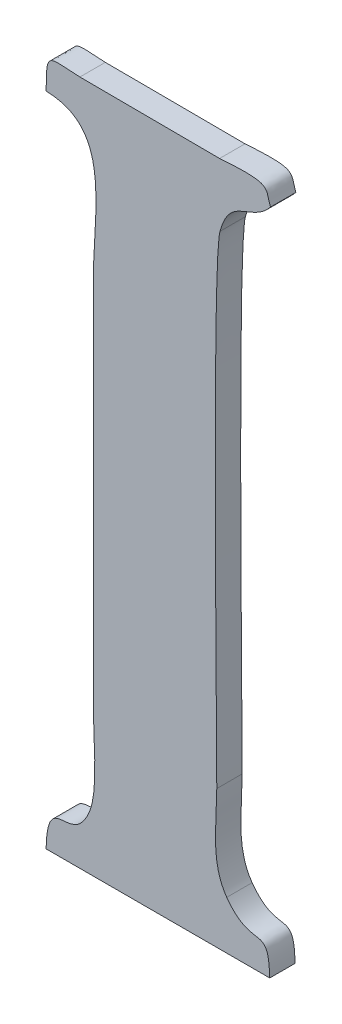
ISO-10303-21;
HEADER;
FILE_DESCRIPTION(('STEP AP214'),'2;1');
FILE_NAME('part.step','',(''),(''),'','','');
FILE_SCHEMA(('AUTOMOTIVE_DESIGN { 1 0 10303 214 1 1 1 1 }'));
ENDSEC;
DATA;
#1=APPLICATION_CONTEXT('core data for automotive mechanical design processes');
#2=APPLICATION_PROTOCOL_DEFINITION('international standard','automotive_design',2000,#1);
#3=PRODUCT_CONTEXT('',#1,'mechanical');
#4=PRODUCT('Part','Part','',(#3));
#5=PRODUCT_RELATED_PRODUCT_CATEGORY('part','',(#4));
#6=PRODUCT_DEFINITION_FORMATION('','',#4);
#7=PRODUCT_DEFINITION_CONTEXT('part definition',#1,'design');
#8=PRODUCT_DEFINITION('design','',#6,#7);
#9=PRODUCT_DEFINITION_SHAPE('','',#8);
#10=(LENGTH_UNIT() NAMED_UNIT(*) SI_UNIT(.MILLI.,.METRE.));
#11=(NAMED_UNIT(*) PLANE_ANGLE_UNIT() SI_UNIT($,.RADIAN.));
#12=(NAMED_UNIT(*) SI_UNIT($,.STERADIAN.) SOLID_ANGLE_UNIT());
#13=UNCERTAINTY_MEASURE_WITH_UNIT(LENGTH_MEASURE(1.E-05),#10,'distance_accuracy_value','');
#14=(GEOMETRIC_REPRESENTATION_CONTEXT(3) GLOBAL_UNCERTAINTY_ASSIGNED_CONTEXT((#13)) GLOBAL_UNIT_ASSIGNED_CONTEXT((#10,
#11,#12)) REPRESENTATION_CONTEXT('',''));
#15=CARTESIAN_POINT('',(0.,0.,0.));
#16=DIRECTION('',(0.,0.,1.));
#17=DIRECTION('',(1.,0.,0.));
#18=AXIS2_PLACEMENT_3D('',#15,#16,#17);
#19=CARTESIAN_POINT('',(0.0584275370021266,11.4810110226735,0.001));
#20=DIRECTION('',(-0.0050889926251414,-0.999987050993192,0.));
#21=DIRECTION('',(0.999987050993192,-0.0050889926251414,0.));
#22=AXIS2_PLACEMENT_3D('',#19,#20,#21);
#23=PLANE('',#22);
#24=DIRECTION('',(-0.999987050993192,0.0050889926251414,0.));
#25=VECTOR('',#24,1.);
#26=CARTESIAN_POINT('',(0.0584275370021266,11.4810110226735,0.));
#27=LINE('',#26,#25);
#28=CARTESIAN_POINT('',(50.1266319999998,11.226211,0.));
#29=VERTEX_POINT('',#28);
#30=CARTESIAN_POINT('',(50.1211299999998,11.226239,0.));
#31=VERTEX_POINT('',#30);
#32=EDGE_CURVE('E11',#29,#31,#27,.T.);
#33=ORIENTED_EDGE('',*,*,#32,.T.);
#34=DIRECTION('',(0.,0.,-1.));
#35=VECTOR('',#34,1.);
#36=CARTESIAN_POINT('',(50.1211299999998,11.226239,0.001));
#37=LINE('',#36,#35);
#38=CARTESIAN_POINT('',(50.1211299999998,11.226239,0.001));
#39=VERTEX_POINT('',#38);
#40=EDGE_CURVE('E24',#39,#31,#37,.T.);
#41=ORIENTED_EDGE('',*,*,#40,.F.);
#42=DIRECTION('',(-0.999987050993192,0.0050889926251414,0.));
#43=VECTOR('',#42,1.);
#44=CARTESIAN_POINT('',(0.0584275370021266,11.4810110226735,0.001));
#45=LINE('',#44,#43);
#46=CARTESIAN_POINT('',(50.1266319999998,11.226211,0.001));
#47=VERTEX_POINT('',#46);
#48=EDGE_CURVE('E284',#47,#39,#45,.T.);
#49=ORIENTED_EDGE('',*,*,#48,.F.);
#50=DIRECTION('',(0.,0.,-1.));
#51=VECTOR('',#50,1.);
#52=CARTESIAN_POINT('',(50.1266319999998,11.226211,0.001));
#53=LINE('',#52,#51);
#54=EDGE_CURVE('E124',#47,#29,#53,.T.);
#55=ORIENTED_EDGE('',*,*,#54,.T.);
#56=EDGE_LOOP('',(#33,#41,#49,#55));
#57=FACE_BOUND('',#56,.T.);
#58=ADVANCED_FACE('F17',(#57),#23,.F.);
#59=CARTESIAN_POINT('',(50.1211299999998,11.226239,0.001));
#60=CARTESIAN_POINT('',(50.1211299999998,11.226239,0.));
#61=CARTESIAN_POINT('',(50.1198139999998,11.226295,0.001));
#62=CARTESIAN_POINT('',(50.1198139999998,11.226295,0.));
#63=CARTESIAN_POINT('',(50.1198139999998,11.226505,0.001));
#64=CARTESIAN_POINT('',(50.1198139999998,11.226505,0.));
#65=CARTESIAN_POINT('',(50.1197999999998,11.225091,0.001));
#66=CARTESIAN_POINT('',(50.1197999999998,11.225091,0.));
#67=B_SPLINE_SURFACE_WITH_KNOTS('',3,1,((#59,#60),(#61,#62),(#63,#64),(#65,#66)),.UNSPECIFIED.,
.F.,.F.,.F.,(4,4),(2,2),(0.846153846153846,1.),(0.,1.),.UNSPECIFIED.);
#68=CARTESIAN_POINT('',(50.1211299999998,11.226239,0.));
#69=CARTESIAN_POINT('',(50.1198139999998,11.226295,0.));
#70=CARTESIAN_POINT('',(50.1198139999998,11.226505,0.));
#71=CARTESIAN_POINT('',(50.1197999999998,11.225091,0.));
#72=B_SPLINE_CURVE_WITH_KNOTS('',3,(#68,#69,#70,#71),.UNSPECIFIED.,.F.,.F.,(4,4),
(0.846153846153846,1.),.UNSPECIFIED.);
#73=CARTESIAN_POINT('',(50.1197999999998,11.225091,0.));
#74=VERTEX_POINT('',#73);
#75=EDGE_CURVE('E275',#31,#74,#72,.T.);
#76=DIRECTION('',(0.,0.,-1.));
#77=VECTOR('',#76,1.);
#78=CARTESIAN_POINT('',(50.1197999999998,11.225091,0.001));
#79=LINE('',#78,#77);
#80=CARTESIAN_POINT('',(50.1197999999998,11.225091,0.001));
#81=VERTEX_POINT('',#80);
#82=EDGE_CURVE('E270',#81,#74,#79,.T.);
#83=CARTESIAN_POINT('',(50.1211299999998,11.226239,0.001));
#84=CARTESIAN_POINT('',(50.1198139999998,11.226295,0.001));
#85=CARTESIAN_POINT('',(50.1198139999998,11.226505,0.001));
#86=CARTESIAN_POINT('',(50.1197999999998,11.225091,0.001));
#87=B_SPLINE_CURVE_WITH_KNOTS('',3,(#83,#84,#85,#86),.UNSPECIFIED.,.F.,.F.,(4,4),
(0.846153846153846,1.),.UNSPECIFIED.);
#88=EDGE_CURVE('E263',#39,#81,#87,.T.);
#89=ORIENTED_EDGE('',*,*,#75,.T.);
#90=ORIENTED_EDGE('',*,*,#82,.F.);
#91=ORIENTED_EDGE('',*,*,#88,.F.);
#92=ORIENTED_EDGE('',*,*,#40,.T.);
#93=EDGE_LOOP('',(#89,#90,#91,#92));
#94=FACE_BOUND('',#93,.T.);
#95=ADVANCED_FACE('F287',(#94),#67,.F.);
#96=CARTESIAN_POINT('',(50.1197999999998,11.225091,0.001));
#97=CARTESIAN_POINT('',(50.1197999999998,11.225091,0.));
#98=CARTESIAN_POINT('',(50.1224179999998,11.225035,0.001));
#99=CARTESIAN_POINT('',(50.1224179999998,11.225035,0.));
#100=CARTESIAN_POINT('',(50.1216619999998,11.221997,0.001));
#101=CARTESIAN_POINT('',(50.1216619999998,11.221997,0.));
#102=CARTESIAN_POINT('',(50.1216619999998,11.219673,0.001));
#103=CARTESIAN_POINT('',(50.1216619999998,11.219673,0.));
#104=B_SPLINE_SURFACE_WITH_KNOTS('',3,1,((#96,#97),(#98,#99),(#100,#101),(#102,#103)),
.UNSPECIFIED.,.F.,.F.,.F.,(4,4),(2,2),(0.,0.0769230769230769),(0.,1.),.UNSPECIFIED.);
#105=CARTESIAN_POINT('',(50.1197999999998,11.225091,0.));
#106=CARTESIAN_POINT('',(50.1224179999998,11.225035,0.));
#107=CARTESIAN_POINT('',(50.1216619999998,11.221997,0.));
#108=CARTESIAN_POINT('',(50.1216619999998,11.219673,0.));
#109=B_SPLINE_CURVE_WITH_KNOTS('',3,(#105,#106,#107,#108),.UNSPECIFIED.,.F.,.F.,(4,4),(0.,
0.0769230769230769),.UNSPECIFIED.);
#110=CARTESIAN_POINT('',(50.1216619999998,11.219673,0.));
#111=VERTEX_POINT('',#110);
#112=EDGE_CURVE('E258',#74,#111,#109,.T.);
#113=DIRECTION('',(0.,0.,-1.));
#114=VECTOR('',#113,1.);
#115=CARTESIAN_POINT('',(50.1216619999998,11.219673,0.001));
#116=LINE('',#115,#114);
#117=CARTESIAN_POINT('',(50.1216619999998,11.219673,0.001));
#118=VERTEX_POINT('',#117);
#119=EDGE_CURVE('E253',#118,#111,#116,.T.);
#120=CARTESIAN_POINT('',(50.1197999999998,11.225091,0.001));
#121=CARTESIAN_POINT('',(50.1224179999998,11.225035,0.001));
#122=CARTESIAN_POINT('',(50.1216619999998,11.221997,0.001));
#123=CARTESIAN_POINT('',(50.1216619999998,11.219673,0.001));
#124=B_SPLINE_CURVE_WITH_KNOTS('',3,(#120,#121,#122,#123),.UNSPECIFIED.,.F.,.F.,(4,4),(0.,
0.0769230769230769),.UNSPECIFIED.);
#125=EDGE_CURVE('E249',#81,#118,#124,.T.);
#126=ORIENTED_EDGE('',*,*,#112,.T.);
#127=ORIENTED_EDGE('',*,*,#119,.F.);
#128=ORIENTED_EDGE('',*,*,#125,.F.);
#129=ORIENTED_EDGE('',*,*,#82,.T.);
#130=EDGE_LOOP('',(#126,#127,#128,#129));
#131=FACE_BOUND('',#130,.T.);
#132=ADVANCED_FACE('F295',(#131),#104,.F.);
#133=CARTESIAN_POINT('',(50.1216619999998,0.,0.001));
#134=DIRECTION('',(1.,0.,0.));
#135=DIRECTION('',(0.,0.,-1.));
#136=AXIS2_PLACEMENT_3D('',#133,#134,#135);
#137=PLANE('',#136);
#138=DIRECTION('',(0.,-1.,0.));
#139=VECTOR('',#138,1.);
#140=CARTESIAN_POINT('',(50.1216619999998,0.,0.));
#141=LINE('',#140,#139);
#142=CARTESIAN_POINT('',(50.1216619999998,11.204917,0.));
#143=VERTEX_POINT('',#142);
#144=EDGE_CURVE('E247',#111,#143,#141,.T.);
#145=ORIENTED_EDGE('',*,*,#144,.T.);
#146=DIRECTION('',(0.,0.,-1.));
#147=VECTOR('',#146,1.);
#148=CARTESIAN_POINT('',(50.1216619999998,11.204917,0.001));
#149=LINE('',#148,#147);
#150=CARTESIAN_POINT('',(50.1216619999998,11.204917,0.001));
#151=VERTEX_POINT('',#150);
#152=EDGE_CURVE('E244',#151,#143,#149,.T.);
#153=ORIENTED_EDGE('',*,*,#152,.F.);
#154=DIRECTION('',(0.,-1.,0.));
#155=VECTOR('',#154,1.);
#156=CARTESIAN_POINT('',(50.1216619999998,0.,0.001));
#157=LINE('',#156,#155);
#158=EDGE_CURVE('E238',#118,#151,#157,.T.);
#159=ORIENTED_EDGE('',*,*,#158,.F.);
#160=ORIENTED_EDGE('',*,*,#119,.T.);
#161=EDGE_LOOP('',(#145,#153,#159,#160));
#162=FACE_BOUND('',#161,.T.);
#163=ADVANCED_FACE('F325',(#162),#137,.F.);
#164=CARTESIAN_POINT('',(50.1216619999998,11.204917,0.001));
#165=CARTESIAN_POINT('',(50.1216619999998,11.204917,0.));
#166=CARTESIAN_POINT('',(50.1216619999998,11.203909,0.001));
#167=CARTESIAN_POINT('',(50.1216619999998,11.203909,0.));
#168=CARTESIAN_POINT('',(50.1218579999998,11.202229,0.001));
#169=CARTESIAN_POINT('',(50.1218579999998,11.202229,0.));
#170=CARTESIAN_POINT('',(50.1215079999998,11.201375,0.001));
#171=CARTESIAN_POINT('',(50.1215079999998,11.201375,0.));
#172=B_SPLINE_SURFACE_WITH_KNOTS('',3,1,((#164,#165),(#166,#167),(#168,#169),(#170,#171)),
.UNSPECIFIED.,.F.,.F.,.F.,(4,4),(2,2),(0.153846153846154,0.230769230769231),(0.,1.),.UNSPECIFIED.);
#173=CARTESIAN_POINT('',(50.1216619999998,11.204917,0.));
#174=CARTESIAN_POINT('',(50.1216619999998,11.203909,0.));
#175=CARTESIAN_POINT('',(50.1218579999998,11.202229,0.));
#176=CARTESIAN_POINT('',(50.1215079999998,11.201375,0.));
#177=B_SPLINE_CURVE_WITH_KNOTS('',3,(#173,#174,#175,#176),.UNSPECIFIED.,.F.,.F.,(4,4),
(0.153846153846154,0.230769230769231),.UNSPECIFIED.);
#178=CARTESIAN_POINT('',(50.1215079999998,11.201375,0.));
#179=VERTEX_POINT('',#178);
#180=EDGE_CURVE('E233',#143,#179,#177,.T.);
#181=DIRECTION('',(0.,0.,-1.));
#182=VECTOR('',#181,1.);
#183=CARTESIAN_POINT('',(50.1215079999998,11.201375,0.001));
#184=LINE('',#183,#182);
#185=CARTESIAN_POINT('',(50.1215079999998,11.201375,0.001));
#186=VERTEX_POINT('',#185);
#187=EDGE_CURVE('E228',#186,#179,#184,.T.);
#188=CARTESIAN_POINT('',(50.1216619999998,11.204917,0.001));
#189=CARTESIAN_POINT('',(50.1216619999998,11.203909,0.001));
#190=CARTESIAN_POINT('',(50.1218579999998,11.202229,0.001));
#191=CARTESIAN_POINT('',(50.1215079999998,11.201375,0.001));
#192=B_SPLINE_CURVE_WITH_KNOTS('',3,(#188,#189,#190,#191),.UNSPECIFIED.,.F.,.F.,(4,4),
(0.153846153846154,0.230769230769231),.UNSPECIFIED.);
#193=EDGE_CURVE('E221',#151,#186,#192,.T.);
#194=ORIENTED_EDGE('',*,*,#180,.T.);
#195=ORIENTED_EDGE('',*,*,#187,.F.);
#196=ORIENTED_EDGE('',*,*,#193,.F.);
#197=ORIENTED_EDGE('',*,*,#152,.T.);
#198=EDGE_LOOP('',(#194,#195,#196,#197));
#199=FACE_BOUND('',#198,.T.);
#200=ADVANCED_FACE('F323',(#199),#172,.F.);
#201=CARTESIAN_POINT('',(50.1215079999998,11.201375,0.001));
#202=CARTESIAN_POINT('',(50.1215079999998,11.201375,0.));
#203=CARTESIAN_POINT('',(50.1208359999998,11.199709,0.001));
#204=CARTESIAN_POINT('',(50.1208359999998,11.199709,0.));
#205=CARTESIAN_POINT('',(50.1198419999998,11.201529,0.001));
#206=CARTESIAN_POINT('',(50.1198419999998,11.201529,0.));
#207=CARTESIAN_POINT('',(50.1197999999998,11.199247,0.001));
#208=CARTESIAN_POINT('',(50.1197999999998,11.199247,0.));
#209=B_SPLINE_SURFACE_WITH_KNOTS('',3,1,((#201,#202),(#203,#204),(#205,#206),(#207,#208)),
.UNSPECIFIED.,.F.,.F.,.F.,(4,4),(2,2),(0.230769230769231,0.307692307692308),(0.,1.),.UNSPECIFIED.);
#210=CARTESIAN_POINT('',(50.1215079999998,11.201375,0.));
#211=CARTESIAN_POINT('',(50.1208359999998,11.199709,0.));
#212=CARTESIAN_POINT('',(50.1198419999998,11.201529,0.));
#213=CARTESIAN_POINT('',(50.1197999999998,11.199247,0.));
#214=B_SPLINE_CURVE_WITH_KNOTS('',3,(#210,#211,#212,#213),.UNSPECIFIED.,.F.,.F.,(4,4),
(0.230769230769231,0.307692307692308),.UNSPECIFIED.);
#215=CARTESIAN_POINT('',(50.1197999999998,11.199247,0.));
#216=VERTEX_POINT('',#215);
#217=EDGE_CURVE('E216',#179,#216,#214,.T.);
#218=DIRECTION('',(0.,0.,-1.));
#219=VECTOR('',#218,1.);
#220=CARTESIAN_POINT('',(50.1197999999998,11.199247,0.001));
#221=LINE('',#220,#219);
#222=CARTESIAN_POINT('',(50.1197999999998,11.199247,0.001));
#223=VERTEX_POINT('',#222);
#224=EDGE_CURVE('E211',#223,#216,#221,.T.);
#225=CARTESIAN_POINT('',(50.1215079999998,11.201375,0.001));
#226=CARTESIAN_POINT('',(50.1208359999998,11.199709,0.001));
#227=CARTESIAN_POINT('',(50.1198419999998,11.201529,0.001));
#228=CARTESIAN_POINT('',(50.1197999999998,11.199247,0.001));
#229=B_SPLINE_CURVE_WITH_KNOTS('',3,(#225,#226,#227,#228),.UNSPECIFIED.,.F.,.F.,(4,4),
(0.230769230769231,0.307692307692308),.UNSPECIFIED.);
#230=EDGE_CURVE('E207',#186,#223,#229,.T.);
#231=ORIENTED_EDGE('',*,*,#217,.T.);
#232=ORIENTED_EDGE('',*,*,#224,.F.);
#233=ORIENTED_EDGE('',*,*,#230,.F.);
#234=ORIENTED_EDGE('',*,*,#187,.T.);
#235=EDGE_LOOP('',(#231,#232,#233,#234));
#236=FACE_BOUND('',#235,.T.);
#237=ADVANCED_FACE('F320',(#236),#209,.F.);
#238=CARTESIAN_POINT('',(0.,11.199247,0.001));
#239=DIRECTION('',(0.,1.,0.));
#240=DIRECTION('',(0.,0.,1.));
#241=AXIS2_PLACEMENT_3D('',#238,#239,#240);
#242=PLANE('',#241);
#243=DIRECTION('',(1.,0.,0.));
#244=VECTOR('',#243,1.);
#245=CARTESIAN_POINT('',(0.,11.199247,0.));
#246=LINE('',#245,#244);
#247=CARTESIAN_POINT('',(50.1286059999998,11.199247,0.));
#248=VERTEX_POINT('',#247);
#249=EDGE_CURVE('E205',#216,#248,#246,.T.);
#250=ORIENTED_EDGE('',*,*,#249,.T.);
#251=DIRECTION('',(0.,0.,-1.));
#252=VECTOR('',#251,1.);
#253=CARTESIAN_POINT('',(50.1286059999998,11.199247,0.001));
#254=LINE('',#253,#252);
#255=CARTESIAN_POINT('',(50.1286059999998,11.199247,0.001));
#256=VERTEX_POINT('',#255);
#257=EDGE_CURVE('E202',#256,#248,#254,.T.);
#258=ORIENTED_EDGE('',*,*,#257,.F.);
#259=DIRECTION('',(1.,0.,0.));
#260=VECTOR('',#259,1.);
#261=CARTESIAN_POINT('',(0.,11.199247,0.001));
#262=LINE('',#261,#260);
#263=EDGE_CURVE('E196',#223,#256,#262,.T.);
#264=ORIENTED_EDGE('',*,*,#263,.F.);
#265=ORIENTED_EDGE('',*,*,#224,.T.);
#266=EDGE_LOOP('',(#250,#258,#264,#265));
#267=FACE_BOUND('',#266,.T.);
#268=ADVANCED_FACE('F315',(#267),#242,.F.);
#269=CARTESIAN_POINT('',(50.1286059999998,11.199247,0.001));
#270=CARTESIAN_POINT('',(50.1286059999998,11.199247,0.));
#271=CARTESIAN_POINT('',(50.1285639999998,11.201165,0.001));
#272=CARTESIAN_POINT('',(50.1285639999998,11.201165,0.));
#273=CARTESIAN_POINT('',(50.1279339999998,11.199751,0.001));
#274=CARTESIAN_POINT('',(50.1279339999998,11.199751,0.));
#275=CARTESIAN_POINT('',(50.1269119999998,11.201151,0.001));
#276=CARTESIAN_POINT('',(50.1269119999998,11.201151,0.));
#277=B_SPLINE_SURFACE_WITH_KNOTS('',3,1,((#269,#270),(#271,#272),(#273,#274),(#275,#276)),
.UNSPECIFIED.,.F.,.F.,.F.,(4,4),(2,2),(0.384615384615385,0.461538461538462),(0.,1.),.UNSPECIFIED.);
#278=CARTESIAN_POINT('',(50.1286059999998,11.199247,0.));
#279=CARTESIAN_POINT('',(50.1285639999998,11.201165,0.));
#280=CARTESIAN_POINT('',(50.1279339999998,11.199751,0.));
#281=CARTESIAN_POINT('',(50.1269119999998,11.201151,0.));
#282=B_SPLINE_CURVE_WITH_KNOTS('',3,(#278,#279,#280,#281),.UNSPECIFIED.,.F.,.F.,(4,4),
(0.384615384615385,0.461538461538462),.UNSPECIFIED.);
#283=CARTESIAN_POINT('',(50.1269119999998,11.201151,0.));
#284=VERTEX_POINT('',#283);
#285=EDGE_CURVE('E191',#248,#284,#282,.T.);
#286=DIRECTION('',(0.,0.,-1.));
#287=VECTOR('',#286,1.);
#288=CARTESIAN_POINT('',(50.1269119999998,11.201151,0.001));
#289=LINE('',#288,#287);
#290=CARTESIAN_POINT('',(50.1269119999998,11.201151,0.001));
#291=VERTEX_POINT('',#290);
#292=EDGE_CURVE('E186',#291,#284,#289,.T.);
#293=CARTESIAN_POINT('',(50.1286059999998,11.199247,0.001));
#294=CARTESIAN_POINT('',(50.1285639999998,11.201165,0.001));
#295=CARTESIAN_POINT('',(50.1279339999998,11.199751,0.001));
#296=CARTESIAN_POINT('',(50.1269119999998,11.201151,0.001));
#297=B_SPLINE_CURVE_WITH_KNOTS('',3,(#293,#294,#295,#296),.UNSPECIFIED.,.F.,.F.,(4,4),
(0.384615384615385,0.461538461538462),.UNSPECIFIED.);
#298=EDGE_CURVE('E179',#256,#291,#297,.T.);
#299=ORIENTED_EDGE('',*,*,#285,.T.);
#300=ORIENTED_EDGE('',*,*,#292,.F.);
#301=ORIENTED_EDGE('',*,*,#298,.F.);
#302=ORIENTED_EDGE('',*,*,#257,.T.);
#303=EDGE_LOOP('',(#299,#300,#301,#302));
#304=FACE_BOUND('',#303,.T.);
#305=ADVANCED_FACE('F311',(#304),#277,.F.);
#306=CARTESIAN_POINT('',(50.1269119999998,11.201151,0.001));
#307=CARTESIAN_POINT('',(50.1269119999998,11.201151,0.));
#308=CARTESIAN_POINT('',(50.1262539999998,11.202061,0.001));
#309=CARTESIAN_POINT('',(50.1262539999998,11.202061,0.));
#310=CARTESIAN_POINT('',(50.1265199999998,11.203517,0.001));
#311=CARTESIAN_POINT('',(50.1265199999998,11.203517,0.));
#312=CARTESIAN_POINT('',(50.1265199999998,11.204665,0.001));
#313=CARTESIAN_POINT('',(50.1265199999998,11.204665,0.));
#314=B_SPLINE_SURFACE_WITH_KNOTS('',3,1,((#306,#307),(#308,#309),(#310,#311),(#312,#313)),
.UNSPECIFIED.,.F.,.F.,.F.,(4,4),(2,2),(0.461538461538462,0.538461538461538),(0.,1.),.UNSPECIFIED.);
#315=CARTESIAN_POINT('',(50.1269119999998,11.201151,0.));
#316=CARTESIAN_POINT('',(50.1262539999998,11.202061,0.));
#317=CARTESIAN_POINT('',(50.1265199999998,11.203517,0.));
#318=CARTESIAN_POINT('',(50.1265199999998,11.204665,0.));
#319=B_SPLINE_CURVE_WITH_KNOTS('',3,(#315,#316,#317,#318),.UNSPECIFIED.,.F.,.F.,(4,4),
(0.461538461538462,0.538461538461538),.UNSPECIFIED.);
#320=CARTESIAN_POINT('',(50.1265199999998,11.204665,0.));
#321=VERTEX_POINT('',#320);
#322=EDGE_CURVE('E174',#284,#321,#319,.T.);
#323=DIRECTION('',(0.,0.,-1.));
#324=VECTOR('',#323,1.);
#325=CARTESIAN_POINT('',(50.1265199999998,11.204665,0.001));
#326=LINE('',#325,#324);
#327=CARTESIAN_POINT('',(50.1265199999998,11.204665,0.001));
#328=VERTEX_POINT('',#327);
#329=EDGE_CURVE('E169',#328,#321,#326,.T.);
#330=CARTESIAN_POINT('',(50.1269119999998,11.201151,0.001));
#331=CARTESIAN_POINT('',(50.1262539999998,11.202061,0.001));
#332=CARTESIAN_POINT('',(50.1265199999998,11.203517,0.001));
#333=CARTESIAN_POINT('',(50.1265199999998,11.204665,0.001));
#334=B_SPLINE_CURVE_WITH_KNOTS('',3,(#330,#331,#332,#333),.UNSPECIFIED.,.F.,.F.,(4,4),
(0.461538461538462,0.538461538461538),.UNSPECIFIED.);
#335=EDGE_CURVE('E162',#291,#328,#334,.T.);
#336=ORIENTED_EDGE('',*,*,#322,.T.);
#337=ORIENTED_EDGE('',*,*,#329,.F.);
#338=ORIENTED_EDGE('',*,*,#335,.F.);
#339=ORIENTED_EDGE('',*,*,#292,.T.);
#340=EDGE_LOOP('',(#336,#337,#338,#339));
#341=FACE_BOUND('',#340,.T.);
#342=ADVANCED_FACE('F307',(#341),#314,.F.);
#343=CARTESIAN_POINT('',(50.1265199999998,11.204665,0.000999999999999998));
#344=CARTESIAN_POINT('',(50.1265199999998,11.204665,0.));
#345=CARTESIAN_POINT('',(50.1265199999998,11.207115,0.000999999999999998));
#346=CARTESIAN_POINT('',(50.1265199999998,11.207115,0.));
#347=CARTESIAN_POINT('',(50.1263239999998,11.222529,0.000999999999999998));
#348=CARTESIAN_POINT('',(50.1263239999998,11.222529,0.));
#349=CARTESIAN_POINT('',(50.1266459999998,11.223733,0.000999999999999998));
#350=CARTESIAN_POINT('',(50.1266459999998,11.223733,0.));
#351=B_SPLINE_SURFACE_WITH_KNOTS('',3,1,((#343,#344),(#345,#346),(#347,#348),(#349,#350)),
.UNSPECIFIED.,.F.,.F.,.F.,(4,4),(2,2),(0.538461538461538,0.615384615384615),(0.,1.),.UNSPECIFIED.);
#352=CARTESIAN_POINT('',(50.1265199999998,11.204665,0.));
#353=CARTESIAN_POINT('',(50.1265199999998,11.207115,0.));
#354=CARTESIAN_POINT('',(50.1263239999998,11.222529,0.));
#355=CARTESIAN_POINT('',(50.1266459999998,11.223733,0.));
#356=B_SPLINE_CURVE_WITH_KNOTS('',3,(#352,#353,#354,#355),.UNSPECIFIED.,.F.,.F.,(4,4),
(0.538461538461538,0.615384615384615),.UNSPECIFIED.);
#357=CARTESIAN_POINT('',(50.1266459999998,11.223733,0.));
#358=VERTEX_POINT('',#357);
#359=EDGE_CURVE('E157',#321,#358,#356,.T.);
#360=DIRECTION('',(0.,0.,-1.));
#361=VECTOR('',#360,1.);
#362=CARTESIAN_POINT('',(50.1266459999998,11.223733,0.000999999999999998));
#363=LINE('',#362,#361);
#364=CARTESIAN_POINT('',(50.1266459999998,11.223733,0.000999999999999998));
#365=VERTEX_POINT('',#364);
#366=EDGE_CURVE('E152',#365,#358,#363,.T.);
#367=CARTESIAN_POINT('',(50.1265199999998,11.204665,0.001));
#368=CARTESIAN_POINT('',(50.1265199999998,11.207115,0.000999999999999998));
#369=CARTESIAN_POINT('',(50.1263239999998,11.222529,0.000999999999999998));
#370=CARTESIAN_POINT('',(50.1266459999998,11.223733,0.000999999999999998));
#371=B_SPLINE_CURVE_WITH_KNOTS('',3,(#367,#368,#369,#370),.UNSPECIFIED.,.F.,.F.,(4,4),
(0.538461538461538,0.615384615384615),.UNSPECIFIED.);
#372=EDGE_CURVE('E109',#328,#365,#371,.T.);
#373=ORIENTED_EDGE('',*,*,#359,.T.);
#374=ORIENTED_EDGE('',*,*,#366,.F.);
#375=ORIENTED_EDGE('',*,*,#372,.F.);
#376=ORIENTED_EDGE('',*,*,#329,.T.);
#377=EDGE_LOOP('',(#373,#374,#375,#376));
#378=FACE_BOUND('',#377,.T.);
#379=ADVANCED_FACE('F303',(#378),#351,.F.);
#380=CARTESIAN_POINT('',(50.1266459999998,11.223733,0.001));
#381=CARTESIAN_POINT('',(50.1266459999998,11.223733,0.));
#382=CARTESIAN_POINT('',(50.1270379999998,11.225203,0.001));
#383=CARTESIAN_POINT('',(50.1270379999998,11.225203,0.));
#384=CARTESIAN_POINT('',(50.1278779999998,11.224629,0.001));
#385=CARTESIAN_POINT('',(50.1278779999998,11.224629,0.));
#386=CARTESIAN_POINT('',(50.1286339999998,11.225553,0.001));
#387=CARTESIAN_POINT('',(50.1286339999998,11.225553,0.));
#388=B_SPLINE_SURFACE_WITH_KNOTS('',3,1,((#380,#381),(#382,#383),(#384,#385),(#386,#387)),
.UNSPECIFIED.,.F.,.F.,.F.,(4,4),(2,2),(0.615384615384615,0.692307692307692),(0.,1.),.UNSPECIFIED.);
#389=CARTESIAN_POINT('',(50.1266459999998,11.223733,0.));
#390=CARTESIAN_POINT('',(50.1270379999998,11.225203,0.));
#391=CARTESIAN_POINT('',(50.1278779999998,11.224629,0.));
#392=CARTESIAN_POINT('',(50.1286339999998,11.225553,0.));
#393=B_SPLINE_CURVE_WITH_KNOTS('',3,(#389,#390,#391,#392),.UNSPECIFIED.,.F.,.F.,(4,4),
(0.615384615384615,0.692307692307692),.UNSPECIFIED.);
#394=CARTESIAN_POINT('',(50.1286339999998,11.225553,0.));
#395=VERTEX_POINT('',#394);
#396=EDGE_CURVE('E118',#358,#395,#393,.T.);
#397=DIRECTION('',(0.,0.,-1.));
#398=VECTOR('',#397,1.);
#399=CARTESIAN_POINT('',(50.1286339999998,11.225553,0.001));
#400=LINE('',#399,#398);
#401=CARTESIAN_POINT('',(50.1286339999998,11.225553,0.001));
#402=VERTEX_POINT('',#401);
#403=EDGE_CURVE('E112',#402,#395,#400,.T.);
#404=CARTESIAN_POINT('',(50.1266459999998,11.223733,0.000999999999999998));
#405=CARTESIAN_POINT('',(50.1270379999998,11.225203,0.001));
#406=CARTESIAN_POINT('',(50.1278779999998,11.224629,0.001));
#407=CARTESIAN_POINT('',(50.1286339999998,11.225553,0.001));
#408=B_SPLINE_CURVE_WITH_KNOTS('',3,(#404,#405,#406,#407),.UNSPECIFIED.,.F.,.F.,(4,4),
(0.615384615384615,0.692307692307692),.UNSPECIFIED.);
#409=EDGE_CURVE('E102',#365,#402,#408,.T.);
#410=ORIENTED_EDGE('',*,*,#396,.T.);
#411=ORIENTED_EDGE('',*,*,#403,.F.);
#412=ORIENTED_EDGE('',*,*,#409,.F.);
#413=ORIENTED_EDGE('',*,*,#366,.T.);
#414=EDGE_LOOP('',(#410,#411,#412,#413));
#415=FACE_BOUND('',#414,.T.);
#416=ADVANCED_FACE('F116',(#415),#388,.F.);
#417=CARTESIAN_POINT('',(50.1286339999998,11.225553,0.000999999999999998));
#418=CARTESIAN_POINT('',(50.1286339999998,11.225553,0.));
#419=CARTESIAN_POINT('',(50.1284099999998,11.226127,0.000999999999999998));
#420=CARTESIAN_POINT('',(50.1284099999998,11.226127,0.));
#421=CARTESIAN_POINT('',(50.1287459999998,11.226365,0.000999999999999998));
#422=CARTESIAN_POINT('',(50.1287459999998,11.226365,0.));
#423=CARTESIAN_POINT('',(50.1266319999998,11.226211,0.000999999999999998));
#424=CARTESIAN_POINT('',(50.1266319999998,11.226211,0.));
#425=B_SPLINE_SURFACE_WITH_KNOTS('',3,1,((#417,#418),(#419,#420),(#421,#422),(#423,#424)),
.UNSPECIFIED.,.F.,.F.,.F.,(4,4),(2,2),(0.692307692307692,0.769230769230769),(0.,1.),.UNSPECIFIED.);
#426=CARTESIAN_POINT('',(50.1286339999998,11.225553,0.));
#427=CARTESIAN_POINT('',(50.1284099999998,11.226127,0.));
#428=CARTESIAN_POINT('',(50.1287459999998,11.226365,0.));
#429=CARTESIAN_POINT('',(50.1266319999998,11.226211,0.));
#430=B_SPLINE_CURVE_WITH_KNOTS('',3,(#426,#427,#428,#429),.UNSPECIFIED.,.F.,.F.,(4,4),
(0.692307692307692,0.769230769230769),.UNSPECIFIED.);
#431=EDGE_CURVE('E113',#395,#29,#430,.T.);
#432=CARTESIAN_POINT('',(50.1286339999998,11.225553,0.001));
#433=CARTESIAN_POINT('',(50.1284099999998,11.226127,0.000999999999999998));
#434=CARTESIAN_POINT('',(50.1287459999998,11.226365,0.000999999999999998));
#435=CARTESIAN_POINT('',(50.1266319999998,11.226211,0.001));
#436=B_SPLINE_CURVE_WITH_KNOTS('',3,(#432,#433,#434,#435),.UNSPECIFIED.,.F.,.F.,(4,4),
(0.692307692307692,0.769230769230769),.UNSPECIFIED.);
#437=EDGE_CURVE('E107',#402,#47,#436,.T.);
#438=ORIENTED_EDGE('',*,*,#431,.T.);
#439=ORIENTED_EDGE('',*,*,#54,.F.);
#440=ORIENTED_EDGE('',*,*,#437,.F.);
#441=ORIENTED_EDGE('',*,*,#403,.T.);
#442=EDGE_LOOP('',(#438,#439,#440,#441));
#443=FACE_BOUND('',#442,.T.);
#444=ADVANCED_FACE('F123',(#443),#425,.F.);
#445=CARTESIAN_POINT('',(0.,0.,0.001));
#446=DIRECTION('',(0.,0.,1.));
#447=DIRECTION('',(1.,0.,0.));
#448=AXIS2_PLACEMENT_3D('',#445,#446,#447);
#449=PLANE('',#448);
#450=ORIENTED_EDGE('',*,*,#48,.T.);
#451=ORIENTED_EDGE('',*,*,#88,.T.);
#452=ORIENTED_EDGE('',*,*,#125,.T.);
#453=ORIENTED_EDGE('',*,*,#158,.T.);
#454=ORIENTED_EDGE('',*,*,#193,.T.);
#455=ORIENTED_EDGE('',*,*,#230,.T.);
#456=ORIENTED_EDGE('',*,*,#263,.T.);
#457=ORIENTED_EDGE('',*,*,#298,.T.);
#458=ORIENTED_EDGE('',*,*,#335,.T.);
#459=ORIENTED_EDGE('',*,*,#372,.T.);
#460=ORIENTED_EDGE('',*,*,#409,.T.);
#461=ORIENTED_EDGE('',*,*,#437,.T.);
#462=EDGE_LOOP('',(#450,#451,#452,#453,#454,#455,#456,#457,#458,#459,#460,#461));
#463=FACE_BOUND('',#462,.T.);
#464=ADVANCED_FACE('F105',(#463),#449,.T.);
#465=CARTESIAN_POINT('',(0.,0.,0.));
#466=DIRECTION('',(0.,0.,1.));
#467=DIRECTION('',(1.,0.,0.));
#468=AXIS2_PLACEMENT_3D('',#465,#466,#467);
#469=PLANE('',#468);
#470=ORIENTED_EDGE('',*,*,#32,.F.);
#471=ORIENTED_EDGE('',*,*,#431,.F.);
#472=ORIENTED_EDGE('',*,*,#396,.F.);
#473=ORIENTED_EDGE('',*,*,#359,.F.);
#474=ORIENTED_EDGE('',*,*,#322,.F.);
#475=ORIENTED_EDGE('',*,*,#285,.F.);
#476=ORIENTED_EDGE('',*,*,#249,.F.);
#477=ORIENTED_EDGE('',*,*,#217,.F.);
#478=ORIENTED_EDGE('',*,*,#180,.F.);
#479=ORIENTED_EDGE('',*,*,#144,.F.);
#480=ORIENTED_EDGE('',*,*,#112,.F.);
#481=ORIENTED_EDGE('',*,*,#75,.F.);
#482=EDGE_LOOP('',(#470,#471,#472,#473,#474,#475,#476,#477,#478,#479,#480,#481));
#483=FACE_BOUND('',#482,.T.);
#484=ADVANCED_FACE('F290',(#483),#469,.F.);
#485=CLOSED_SHELL('',(#58,#95,#132,#163,#200,#237,#268,#305,#342,#379,#416,#444,#464,#484));
#486=MANIFOLD_SOLID_BREP('B1',#485);
#487=ADVANCED_BREP_SHAPE_REPRESENTATION('',(#18,#486),#14);
#488=SHAPE_DEFINITION_REPRESENTATION(#9,#487);
ENDSEC;
END-ISO-10303-21;
